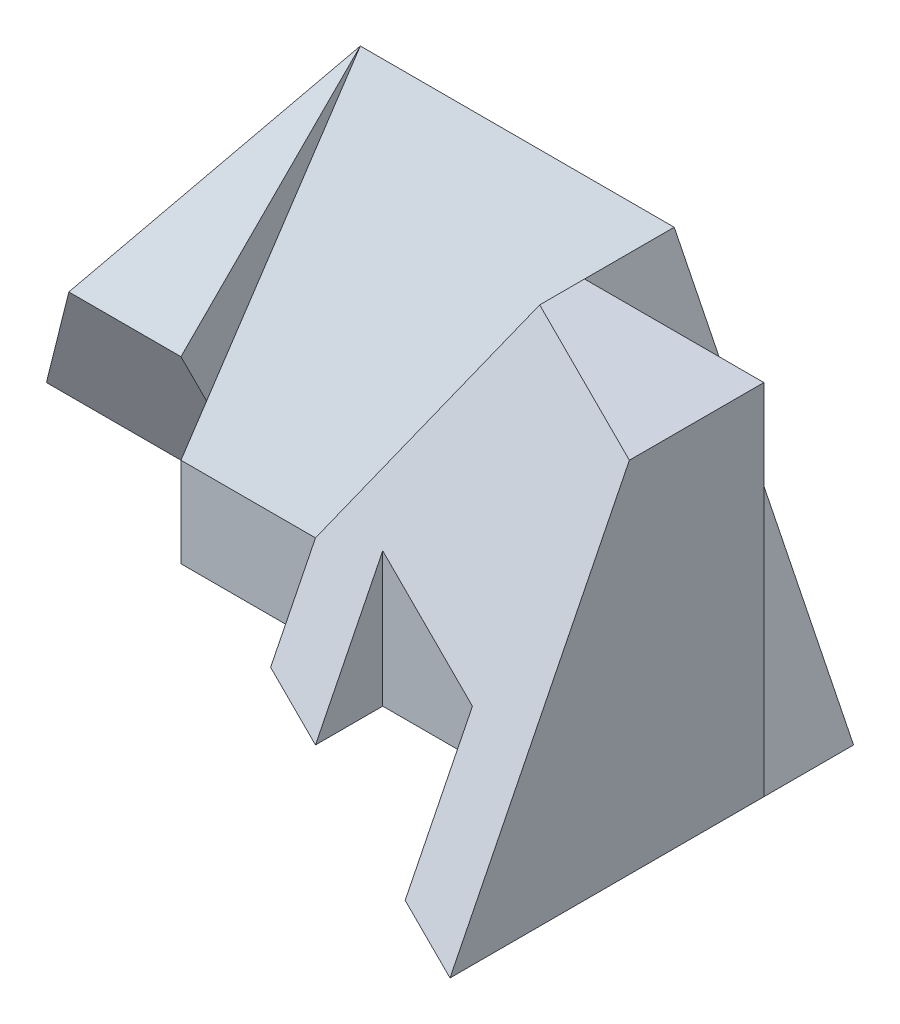
ISO-10303-21;
HEADER;
FILE_DESCRIPTION(('STEP AP214'),'2;1');
FILE_NAME('part.step','',(''),(''),'','','');
FILE_SCHEMA(('AUTOMOTIVE_DESIGN { 1 0 10303 214 1 1 1 1 }'));
ENDSEC;
DATA;
#1=APPLICATION_CONTEXT('core data for automotive mechanical design processes');
#2=APPLICATION_PROTOCOL_DEFINITION('international standard','automotive_design',2000,#1);
#3=PRODUCT_CONTEXT('',#1,'mechanical');
#4=PRODUCT('Part','Part','',(#3));
#5=PRODUCT_RELATED_PRODUCT_CATEGORY('part','',(#4));
#6=PRODUCT_DEFINITION_FORMATION('','',#4);
#7=PRODUCT_DEFINITION_CONTEXT('part definition',#1,'design');
#8=PRODUCT_DEFINITION('design','',#6,#7);
#9=PRODUCT_DEFINITION_SHAPE('','',#8);
#10=(LENGTH_UNIT() NAMED_UNIT(*) SI_UNIT(.MILLI.,.METRE.));
#11=(NAMED_UNIT(*) PLANE_ANGLE_UNIT() SI_UNIT($,.RADIAN.));
#12=(NAMED_UNIT(*) SI_UNIT($,.STERADIAN.) SOLID_ANGLE_UNIT());
#13=UNCERTAINTY_MEASURE_WITH_UNIT(LENGTH_MEASURE(1.E-05),#10,'distance_accuracy_value','');
#14=(GEOMETRIC_REPRESENTATION_CONTEXT(3) GLOBAL_UNCERTAINTY_ASSIGNED_CONTEXT((#13)) GLOBAL_UNIT_ASSIGNED_CONTEXT((#10,
#11,#12)) REPRESENTATION_CONTEXT('',''));
#15=CARTESIAN_POINT('',(0.,0.,0.));
#16=DIRECTION('',(0.,0.,1.));
#17=DIRECTION('',(1.,0.,0.));
#18=AXIS2_PLACEMENT_3D('',#15,#16,#17);
#19=CARTESIAN_POINT('',(0.,4.,4.));
#20=DIRECTION('',(0.,1.,0.));
#21=DIRECTION('',(0.,0.,1.));
#22=AXIS2_PLACEMENT_3D('',#19,#20,#21);
#23=PLANE('',#22);
#24=DIRECTION('',(0.,0.,1.));
#25=VECTOR('',#24,1.);
#26=CARTESIAN_POINT('',(1.5,4.,0.));
#27=LINE('',#26,#25);
#28=CARTESIAN_POINT('',(1.5,4.,2.));
#29=VERTEX_POINT('',#28);
#30=CARTESIAN_POINT('',(1.5,4.,3.));
#31=VERTEX_POINT('',#30);
#32=EDGE_CURVE('E163',#29,#31,#27,.T.);
#33=ORIENTED_EDGE('',*,*,#32,.T.);
#34=DIRECTION('',(0.894427190999916,0.,0.447213595499958));
#35=VECTOR('',#34,1.);
#36=CARTESIAN_POINT('',(1.5,4.,3.));
#37=LINE('',#36,#35);
#38=CARTESIAN_POINT('',(5.5,4.,5.));
#39=VERTEX_POINT('',#38);
#40=EDGE_CURVE('E77',#31,#39,#37,.T.);
#41=ORIENTED_EDGE('',*,*,#40,.T.);
#42=DIRECTION('',(0.,0.,-1.));
#43=VECTOR('',#42,1.);
#44=CARTESIAN_POINT('',(5.5,4.,4.));
#45=LINE('',#44,#43);
#46=CARTESIAN_POINT('',(5.5,4.,2.));
#47=VERTEX_POINT('',#46);
#48=EDGE_CURVE('E82',#39,#47,#45,.T.);
#49=ORIENTED_EDGE('',*,*,#48,.T.);
#50=DIRECTION('',(1.,0.,0.));
#51=VECTOR('',#50,1.);
#52=CARTESIAN_POINT('',(1.5,4.,2.));
#53=LINE('',#52,#51);
#54=EDGE_CURVE('E228',#29,#47,#53,.T.);
#55=ORIENTED_EDGE('',*,*,#54,.F.);
#56=EDGE_LOOP('',(#33,#41,#49,#55));
#57=FACE_BOUND('',#56,.T.);
#58=ADVANCED_FACE('F39',(#57),#23,.T.);
#59=CARTESIAN_POINT('',(-2.5,-2.,4.));
#60=DIRECTION('',(0.832050294337844,-0.554700196225229,0.));
#61=DIRECTION('',(0.554700196225229,0.832050294337844,0.));
#62=AXIS2_PLACEMENT_3D('',#59,#60,#61);
#63=PLANE('',#62);
#64=DIRECTION('',(0.549442255794756,0.824163383692134,-0.137360563948689));
#65=VECTOR('',#64,1.);
#66=CARTESIAN_POINT('',(-2.5,-2.,4.));
#67=LINE('',#66,#65);
#68=CARTESIAN_POINT('',(-2.5,-2.,4.));
#69=VERTEX_POINT('',#68);
#70=EDGE_CURVE('E71',#69,#31,#67,.T.);
#71=ORIENTED_EDGE('',*,*,#70,.T.);
#72=ORIENTED_EDGE('',*,*,#32,.F.);
#73=CARTESIAN_POINT('',(1.5,4.,0.));
#74=VERTEX_POINT('',#73);
#75=EDGE_CURVE('E112',#74,#29,#27,.T.);
#76=ORIENTED_EDGE('',*,*,#75,.F.);
#77=DIRECTION('',(0.485071250072666,0.727606875108999,-0.485071250072666));
#78=VECTOR('',#77,1.);
#79=CARTESIAN_POINT('',(-2.5,-2.,4.));
#80=LINE('',#79,#78);
#81=EDGE_CURVE('E108',#69,#74,#80,.T.);
#82=ORIENTED_EDGE('',*,*,#81,.F.);
#83=EDGE_LOOP('',(#71,#72,#76,#82));
#84=FACE_BOUND('',#83,.T.);
#85=ADVANCED_FACE('F109',(#84),#63,.F.);
#86=CARTESIAN_POINT('',(-2.5,-2.,9.));
#87=DIRECTION('',(1.,0.,0.));
#88=DIRECTION('',(0.,0.,-1.));
#89=AXIS2_PLACEMENT_3D('',#86,#87,#88);
#90=PLANE('',#89);
#91=DIRECTION('',(0.,0.894427190999916,-0.447213595499958));
#92=VECTOR('',#91,1.);
#93=CARTESIAN_POINT('',(-2.5,-4.,5.));
#94=LINE('',#93,#92);
#95=CARTESIAN_POINT('',(-2.5,-4.,5.));
#96=VERTEX_POINT('',#95);
#97=EDGE_CURVE('E74',#96,#69,#94,.T.);
#98=ORIENTED_EDGE('',*,*,#97,.T.);
#99=DIRECTION('',(0.,-1.,0.));
#100=VECTOR('',#99,1.);
#101=CARTESIAN_POINT('',(-2.5,-2.,4.));
#102=LINE('',#101,#100);
#103=CARTESIAN_POINT('',(-2.5,-4.,4.));
#104=VERTEX_POINT('',#103);
#105=EDGE_CURVE('E90',#69,#104,#102,.T.);
#106=ORIENTED_EDGE('',*,*,#105,.T.);
#107=DIRECTION('',(0.,0.,-1.));
#108=VECTOR('',#107,1.);
#109=CARTESIAN_POINT('',(-2.5,-4.,9.));
#110=LINE('',#109,#108);
#111=EDGE_CURVE('E92',#96,#104,#110,.T.);
#112=ORIENTED_EDGE('',*,*,#111,.F.);
#113=EDGE_LOOP('',(#98,#106,#112));
#114=FACE_BOUND('',#113,.T.);
#115=ADVANCED_FACE('F88',(#114),#90,.F.);
#116=CARTESIAN_POINT('',(-0.5,-4.,4.5));
#117=DIRECTION('',(-1.,0.,0.));
#118=DIRECTION('',(0.,0.,1.));
#119=AXIS2_PLACEMENT_3D('',#116,#117,#118);
#120=PLANE('',#119);
#121=DIRECTION('',(0.,0.894427190999916,-0.447213595499958));
#122=VECTOR('',#121,1.);
#123=CARTESIAN_POINT('',(-0.5,-3.4,5.7));
#124=LINE('',#123,#122);
#125=CARTESIAN_POINT('',(-0.500000000000001,-4.,6.));
#126=VERTEX_POINT('',#125);
#127=CARTESIAN_POINT('',(-0.5,-1.,4.5));
#128=VERTEX_POINT('',#127);
#129=EDGE_CURVE('E188',#126,#128,#124,.T.);
#130=ORIENTED_EDGE('',*,*,#129,.F.);
#131=DIRECTION('',(0.,0.,1.));
#132=VECTOR('',#131,1.);
#133=CARTESIAN_POINT('',(-0.5,-4.,4.5));
#134=LINE('',#133,#132);
#135=CARTESIAN_POINT('',(-0.5,-4.,4.5));
#136=VERTEX_POINT('',#135);
#137=EDGE_CURVE('E181',#136,#126,#134,.T.);
#138=ORIENTED_EDGE('',*,*,#137,.F.);
#139=DIRECTION('',(0.,-1.,0.));
#140=VECTOR('',#139,1.);
#141=CARTESIAN_POINT('',(-0.5,-4.,4.5));
#142=LINE('',#141,#140);
#143=EDGE_CURVE('E186',#128,#136,#142,.T.);
#144=ORIENTED_EDGE('',*,*,#143,.F.);
#145=EDGE_LOOP('',(#130,#138,#144));
#146=FACE_BOUND('',#145,.T.);
#147=ADVANCED_FACE('F409',(#146),#120,.F.);
#148=CARTESIAN_POINT('',(-0.5,-1.,4.5));
#149=DIRECTION('',(0.,1.,0.));
#150=DIRECTION('',(0.,0.,1.));
#151=AXIS2_PLACEMENT_3D('',#148,#149,#150);
#152=PLANE('',#151);
#153=DIRECTION('',(0.894427190999916,0.,0.447213595499958));
#154=VECTOR('',#153,1.);
#155=CARTESIAN_POINT('',(-0.500000000000002,-1.,4.5));
#156=LINE('',#155,#154);
#157=CARTESIAN_POINT('',(3.5,-1.,6.5));
#158=VERTEX_POINT('',#157);
#159=EDGE_CURVE('E49',#128,#158,#156,.T.);
#160=ORIENTED_EDGE('',*,*,#159,.F.);
#161=DIRECTION('',(-1.,0.,0.));
#162=VECTOR('',#161,1.);
#163=CARTESIAN_POINT('',(-0.5,-1.,4.5));
#164=LINE('',#163,#162);
#165=CARTESIAN_POINT('',(3.5,-1.,4.5));
#166=VERTEX_POINT('',#165);
#167=EDGE_CURVE('E191',#166,#128,#164,.T.);
#168=ORIENTED_EDGE('',*,*,#167,.F.);
#169=DIRECTION('',(0.,0.,1.));
#170=VECTOR('',#169,1.);
#171=CARTESIAN_POINT('',(3.5,-1.,4.5));
#172=LINE('',#171,#170);
#173=EDGE_CURVE('E104',#166,#158,#172,.T.);
#174=ORIENTED_EDGE('',*,*,#173,.T.);
#175=EDGE_LOOP('',(#160,#168,#174));
#176=FACE_BOUND('',#175,.T.);
#177=ADVANCED_FACE('F405',(#176),#152,.F.);
#178=CARTESIAN_POINT('',(3.5,-4.,4.5));
#179=DIRECTION('',(1.,0.,0.));
#180=DIRECTION('',(0.,0.,-1.));
#181=AXIS2_PLACEMENT_3D('',#178,#179,#180);
#182=PLANE('',#181);
#183=DIRECTION('',(0.,-0.894427190999916,0.447213595499958));
#184=VECTOR('',#183,1.);
#185=CARTESIAN_POINT('',(3.5,-2.6,7.3));
#186=LINE('',#185,#184);
#187=CARTESIAN_POINT('',(3.5,-4.,8.));
#188=VERTEX_POINT('',#187);
#189=EDGE_CURVE('E12',#158,#188,#186,.T.);
#190=ORIENTED_EDGE('',*,*,#189,.F.);
#191=ORIENTED_EDGE('',*,*,#173,.F.);
#192=DIRECTION('',(0.,1.,0.));
#193=VECTOR('',#192,1.);
#194=CARTESIAN_POINT('',(3.5,-4.,4.5));
#195=LINE('',#194,#193);
#196=CARTESIAN_POINT('',(3.5,-4.,4.5));
#197=VERTEX_POINT('',#196);
#198=EDGE_CURVE('E218',#197,#166,#195,.T.);
#199=ORIENTED_EDGE('',*,*,#198,.F.);
#200=DIRECTION('',(0.,0.,1.));
#201=VECTOR('',#200,1.);
#202=CARTESIAN_POINT('',(3.5,-4.,4.5));
#203=LINE('',#202,#201);
#204=EDGE_CURVE('E200',#197,#188,#203,.T.);
#205=ORIENTED_EDGE('',*,*,#204,.T.);
#206=EDGE_LOOP('',(#190,#191,#199,#205));
#207=FACE_BOUND('',#206,.T.);
#208=ADVANCED_FACE('F408',(#207),#182,.F.);
#209=CARTESIAN_POINT('',(5.5,0.,4.));
#210=DIRECTION('',(-1.,0.,0.));
#211=DIRECTION('',(0.,0.,1.));
#212=AXIS2_PLACEMENT_3D('',#209,#210,#211);
#213=PLANE('',#212);
#214=ORIENTED_EDGE('',*,*,#48,.F.);
#215=DIRECTION('',(0.,-0.894427190999916,0.447213595499958));
#216=VECTOR('',#215,1.);
#217=CARTESIAN_POINT('',(5.5,4.,5.));
#218=LINE('',#217,#216);
#219=CARTESIAN_POINT('',(5.5,-4.,9.));
#220=VERTEX_POINT('',#219);
#221=EDGE_CURVE('E160',#39,#220,#218,.T.);
#222=ORIENTED_EDGE('',*,*,#221,.T.);
#223=DIRECTION('',(0.,0.,-1.));
#224=VECTOR('',#223,1.);
#225=CARTESIAN_POINT('',(5.5,-4.,4.));
#226=LINE('',#225,#224);
#227=CARTESIAN_POINT('',(5.5,-4.,2.));
#228=VERTEX_POINT('',#227);
#229=EDGE_CURVE('E148',#220,#228,#226,.T.);
#230=ORIENTED_EDGE('',*,*,#229,.T.);
#231=DIRECTION('',(0.,-1.,0.));
#232=VECTOR('',#231,1.);
#233=CARTESIAN_POINT('',(5.5,0.,2.));
#234=LINE('',#233,#232);
#235=EDGE_CURVE('E314',#47,#228,#234,.T.);
#236=ORIENTED_EDGE('',*,*,#235,.F.);
#237=EDGE_LOOP('',(#214,#222,#230,#236));
#238=FACE_BOUND('',#237,.T.);
#239=ADVANCED_FACE('F41',(#238),#213,.F.);
#240=CARTESIAN_POINT('',(-5.75280898876405,3.59550561797753,4.));
#241=DIRECTION('',(0.847998304005088,-0.52999894000318,0.));
#242=DIRECTION('',(0.52999894000318,0.847998304005088,0.));
#243=AXIS2_PLACEMENT_3D('',#240,#241,#242);
#244=PLANE('',#243);
#245=DIRECTION('',(-0.487950036474267,-0.780720058358827,-0.390360029179413));
#246=VECTOR('',#245,1.);
#247=CARTESIAN_POINT('',(-6.0952380952381,3.04761904761905,5.52380952380952));
#248=LINE('',#247,#246);
#249=CARTESIAN_POINT('',(-8.,0.,4.));
#250=VERTEX_POINT('',#249);
#251=CARTESIAN_POINT('',(-10.5,-4.,2.));
#252=VERTEX_POINT('',#251);
#253=EDGE_CURVE('E116',#250,#252,#248,.T.);
#254=ORIENTED_EDGE('',*,*,#253,.F.);
#255=DIRECTION('',(-0.404226041727222,-0.646761666763555,0.646761666763555));
#256=VECTOR('',#255,1.);
#257=CARTESIAN_POINT('',(-5.5,4.,0.));
#258=LINE('',#257,#256);
#259=CARTESIAN_POINT('',(-5.5,4.,0.));
#260=VERTEX_POINT('',#259);
#261=EDGE_CURVE('E247',#260,#250,#258,.T.);
#262=ORIENTED_EDGE('',*,*,#261,.F.);
#263=DIRECTION('',(-0.52999894000318,-0.847998304005088,0.));
#264=VECTOR('',#263,1.);
#265=CARTESIAN_POINT('',(-5.75280898876405,3.59550561797753,0.));
#266=LINE('',#265,#264);
#267=CARTESIAN_POINT('',(-8.,0.,0.));
#268=VERTEX_POINT('',#267);
#269=EDGE_CURVE('E144',#260,#268,#266,.T.);
#270=ORIENTED_EDGE('',*,*,#269,.T.);
#271=DIRECTION('',(0.,0.,-1.));
#272=VECTOR('',#271,1.);
#273=CARTESIAN_POINT('',(-8.,0.,1.));
#274=LINE('',#273,#272);
#275=CARTESIAN_POINT('',(-8.,0.,1.));
#276=VERTEX_POINT('',#275);
#277=EDGE_CURVE('E250',#276,#268,#274,.T.);
#278=ORIENTED_EDGE('',*,*,#277,.F.);
#279=DIRECTION('',(-0.52999894000318,-0.847998304005088,0.));
#280=VECTOR('',#279,1.);
#281=CARTESIAN_POINT('',(-5.75280898876405,3.59550561797753,1.));
#282=LINE('',#281,#280);
#283=CARTESIAN_POINT('',(-10.5,-4.,1.));
#284=VERTEX_POINT('',#283);
#285=EDGE_CURVE('E147',#276,#284,#282,.T.);
#286=ORIENTED_EDGE('',*,*,#285,.T.);
#287=DIRECTION('',(0.,0.,-1.));
#288=VECTOR('',#287,1.);
#289=CARTESIAN_POINT('',(-10.5,-4.,4.));
#290=LINE('',#289,#288);
#291=EDGE_CURVE('E149',#252,#284,#290,.T.);
#292=ORIENTED_EDGE('',*,*,#291,.F.);
#293=EDGE_LOOP('',(#254,#262,#270,#278,#286,#292));
#294=FACE_BOUND('',#293,.T.);
#295=ADVANCED_FACE('F276',(#294),#244,.F.);
#296=CARTESIAN_POINT('',(0.,-4.,4.));
#297=DIRECTION('',(0.,1.,0.));
#298=DIRECTION('',(0.,0.,1.));
#299=AXIS2_PLACEMENT_3D('',#296,#297,#298);
#300=PLANE('',#299);
#301=ORIENTED_EDGE('',*,*,#229,.F.);
#302=DIRECTION('',(-0.894427190999916,0.,-0.447213595499958));
#303=VECTOR('',#302,1.);
#304=CARTESIAN_POINT('',(-0.9,-4.,5.8));
#305=LINE('',#304,#303);
#306=EDGE_CURVE('E176',#220,#188,#305,.T.);
#307=ORIENTED_EDGE('',*,*,#306,.T.);
#308=ORIENTED_EDGE('',*,*,#204,.F.);
#309=DIRECTION('',(1.,0.,0.));
#310=VECTOR('',#309,1.);
#311=CARTESIAN_POINT('',(-0.5,-4.,4.5));
#312=LINE('',#311,#310);
#313=EDGE_CURVE('E220',#136,#197,#312,.T.);
#314=ORIENTED_EDGE('',*,*,#313,.F.);
#315=ORIENTED_EDGE('',*,*,#137,.T.);
#316=EDGE_CURVE('E58',#126,#96,#305,.T.);
#317=ORIENTED_EDGE('',*,*,#316,.T.);
#318=ORIENTED_EDGE('',*,*,#111,.T.);
#319=DIRECTION('',(1.,0.,0.));
#320=VECTOR('',#319,1.);
#321=CARTESIAN_POINT('',(0.,-4.,4.));
#322=LINE('',#321,#320);
#323=CARTESIAN_POINT('',(-5.5,-4.,4.));
#324=VERTEX_POINT('',#323);
#325=EDGE_CURVE('E103',#324,#104,#322,.T.);
#326=ORIENTED_EDGE('',*,*,#325,.F.);
#327=DIRECTION('',(0.,0.,1.));
#328=VECTOR('',#327,1.);
#329=CARTESIAN_POINT('',(-5.5,-4.,4.));
#330=LINE('',#329,#328);
#331=CARTESIAN_POINT('',(-5.5,-4.,2.));
#332=VERTEX_POINT('',#331);
#333=EDGE_CURVE('E324',#332,#324,#330,.T.);
#334=ORIENTED_EDGE('',*,*,#333,.F.);
#335=DIRECTION('',(1.,0.,0.));
#336=VECTOR('',#335,1.);
#337=CARTESIAN_POINT('',(-29.,-4.,2.));
#338=LINE('',#337,#336);
#339=EDGE_CURVE('E336',#252,#332,#338,.T.);
#340=ORIENTED_EDGE('',*,*,#339,.F.);
#341=ORIENTED_EDGE('',*,*,#291,.T.);
#342=DIRECTION('',(-1.,0.,0.));
#343=VECTOR('',#342,1.);
#344=CARTESIAN_POINT('',(-8.,-4.,1.));
#345=LINE('',#344,#343);
#346=CARTESIAN_POINT('',(-8.,-4.,1.));
#347=VERTEX_POINT('',#346);
#348=EDGE_CURVE('E260',#347,#284,#345,.T.);
#349=ORIENTED_EDGE('',*,*,#348,.F.);
#350=DIRECTION('',(0.,0.,-1.));
#351=VECTOR('',#350,1.);
#352=CARTESIAN_POINT('',(-8.,-4.,1.));
#353=LINE('',#352,#351);
#354=CARTESIAN_POINT('',(-8.,-4.,0.));
#355=VERTEX_POINT('',#354);
#356=EDGE_CURVE('E152',#347,#355,#353,.T.);
#357=ORIENTED_EDGE('',*,*,#356,.T.);
#358=DIRECTION('',(1.,0.,0.));
#359=VECTOR('',#358,1.);
#360=CARTESIAN_POINT('',(0.,-4.,0.));
#361=LINE('',#360,#359);
#362=CARTESIAN_POINT('',(5.5,-4.,0.));
#363=VERTEX_POINT('',#362);
#364=EDGE_CURVE('E161',#355,#363,#361,.T.);
#365=ORIENTED_EDGE('',*,*,#364,.T.);
#366=DIRECTION('',(0.,0.,1.));
#367=VECTOR('',#366,1.);
#368=CARTESIAN_POINT('',(5.5,-4.,0.));
#369=LINE('',#368,#367);
#370=EDGE_CURVE('E304',#363,#228,#369,.T.);
#371=ORIENTED_EDGE('',*,*,#370,.T.);
#372=EDGE_LOOP('',(#301,#307,#308,#314,#315,#317,#318,#326,#334,#340,#341,#349,#357,#365,#371));
#373=FACE_BOUND('',#372,.T.);
#374=ADVANCED_FACE('F296',(#373),#300,.F.);
#375=CARTESIAN_POINT('',(0.,0.,4.));
#376=DIRECTION('',(0.,0.,1.));
#377=DIRECTION('',(1.,0.,0.));
#378=AXIS2_PLACEMENT_3D('',#375,#376,#377);
#379=PLANE('',#378);
#380=ORIENTED_EDGE('',*,*,#105,.F.);
#381=DIRECTION('',(1.,0.,0.));
#382=VECTOR('',#381,1.);
#383=CARTESIAN_POINT('',(-5.5,-2.,4.));
#384=LINE('',#383,#382);
#385=CARTESIAN_POINT('',(-5.5,-2.,4.));
#386=VERTEX_POINT('',#385);
#387=EDGE_CURVE('E101',#386,#69,#384,.T.);
#388=ORIENTED_EDGE('',*,*,#387,.F.);
#389=DIRECTION('',(0.,1.,0.));
#390=VECTOR('',#389,1.);
#391=CARTESIAN_POINT('',(-5.5,0.,4.));
#392=LINE('',#391,#390);
#393=EDGE_CURVE('E321',#324,#386,#392,.T.);
#394=ORIENTED_EDGE('',*,*,#393,.F.);
#395=ORIENTED_EDGE('',*,*,#325,.T.);
#396=EDGE_LOOP('',(#380,#388,#394,#395));
#397=FACE_BOUND('',#396,.T.);
#398=ADVANCED_FACE('F97',(#397),#379,.T.);
#399=CARTESIAN_POINT('',(-5.5,4.,0.));
#400=DIRECTION('',(-1.,0.,0.));
#401=DIRECTION('',(0.,-1.,0.));
#402=AXIS2_PLACEMENT_3D('',#399,#400,#401);
#403=PLANE('',#402);
#404=DIRECTION('',(0.,-0.894427190999916,-0.447213595499958));
#405=VECTOR('',#404,1.);
#406=CARTESIAN_POINT('',(-5.5,-4.,2.));
#407=LINE('',#406,#405);
#408=CARTESIAN_POINT('',(-5.5,0.,4.));
#409=VERTEX_POINT('',#408);
#410=CARTESIAN_POINT('',(-5.5,-1.14285714285714,3.42857142857143));
#411=VERTEX_POINT('',#410);
#412=EDGE_CURVE('E135',#409,#411,#407,.T.);
#413=ORIENTED_EDGE('',*,*,#412,.T.);
#414=DIRECTION('',(0.,-0.832050294337844,0.554700196225229));
#415=VECTOR('',#414,1.);
#416=CARTESIAN_POINT('',(-5.5,4.,0.));
#417=LINE('',#416,#415);
#418=EDGE_CURVE('E124',#260,#411,#417,.T.);
#419=ORIENTED_EDGE('',*,*,#418,.F.);
#420=DIRECTION('',(0.,0.707106781186548,-0.707106781186548));
#421=VECTOR('',#420,1.);
#422=CARTESIAN_POINT('',(-5.5,0.,4.));
#423=LINE('',#422,#421);
#424=EDGE_CURVE('E240',#409,#260,#423,.T.);
#425=ORIENTED_EDGE('',*,*,#424,.F.);
#426=EDGE_LOOP('',(#413,#419,#425));
#427=FACE_BOUND('',#426,.T.);
#428=ADVANCED_FACE('F430',(#427),#403,.F.);
#429=CARTESIAN_POINT('',(0.,0.,0.));
#430=DIRECTION('',(0.,0.,1.));
#431=DIRECTION('',(1.,0.,0.));
#432=AXIS2_PLACEMENT_3D('',#429,#430,#431);
#433=PLANE('',#432);
#434=DIRECTION('',(1.,0.,0.));
#435=VECTOR('',#434,1.);
#436=CARTESIAN_POINT('',(0.,4.,0.));
#437=LINE('',#436,#435);
#438=EDGE_CURVE('E139',#260,#74,#437,.T.);
#439=ORIENTED_EDGE('',*,*,#438,.T.);
#440=DIRECTION('',(0.447213595499958,-0.894427190999916,0.));
#441=VECTOR('',#440,1.);
#442=CARTESIAN_POINT('',(1.5,4.,0.));
#443=LINE('',#442,#441);
#444=EDGE_CURVE('E141',#74,#363,#443,.T.);
#445=ORIENTED_EDGE('',*,*,#444,.T.);
#446=ORIENTED_EDGE('',*,*,#364,.F.);
#447=DIRECTION('',(0.,-1.,0.));
#448=VECTOR('',#447,1.);
#449=CARTESIAN_POINT('',(-8.,-4.,0.));
#450=LINE('',#449,#448);
#451=EDGE_CURVE('E263',#268,#355,#450,.T.);
#452=ORIENTED_EDGE('',*,*,#451,.F.);
#453=ORIENTED_EDGE('',*,*,#269,.F.);
#454=EDGE_LOOP('',(#439,#445,#446,#452,#453));
#455=FACE_BOUND('',#454,.T.);
#456=ADVANCED_FACE('F302',(#455),#433,.F.);
#457=CARTESIAN_POINT('',(0.,0.,1.));
#458=DIRECTION('',(0.,0.,1.));
#459=DIRECTION('',(1.,0.,0.));
#460=AXIS2_PLACEMENT_3D('',#457,#458,#459);
#461=PLANE('',#460);
#462=DIRECTION('',(0.,-1.,0.));
#463=VECTOR('',#462,1.);
#464=CARTESIAN_POINT('',(-8.,-4.,1.));
#465=LINE('',#464,#463);
#466=EDGE_CURVE('E257',#276,#347,#465,.T.);
#467=ORIENTED_EDGE('',*,*,#466,.T.);
#468=ORIENTED_EDGE('',*,*,#348,.T.);
#469=ORIENTED_EDGE('',*,*,#285,.F.);
#470=EDGE_LOOP('',(#467,#468,#469));
#471=FACE_BOUND('',#470,.T.);
#472=ADVANCED_FACE('F282',(#471),#461,.F.);
#473=CARTESIAN_POINT('',(-8.,-4.,1.));
#474=DIRECTION('',(1.,0.,0.));
#475=DIRECTION('',(0.,0.,-1.));
#476=AXIS2_PLACEMENT_3D('',#473,#474,#475);
#477=PLANE('',#476);
#478=ORIENTED_EDGE('',*,*,#451,.T.);
#479=ORIENTED_EDGE('',*,*,#356,.F.);
#480=ORIENTED_EDGE('',*,*,#466,.F.);
#481=ORIENTED_EDGE('',*,*,#277,.T.);
#482=EDGE_LOOP('',(#478,#479,#480,#481));
#483=FACE_BOUND('',#482,.T.);
#484=ADVANCED_FACE('F289',(#483),#477,.F.);
#485=CARTESIAN_POINT('',(0.,2.,2.));
#486=DIRECTION('',(0.,-0.707106781186547,-0.707106781186548));
#487=DIRECTION('',(0.,0.707106781186548,-0.707106781186547));
#488=AXIS2_PLACEMENT_3D('',#485,#486,#487);
#489=PLANE('',#488);
#490=ORIENTED_EDGE('',*,*,#261,.T.);
#491=DIRECTION('',(1.,0.,0.));
#492=VECTOR('',#491,1.);
#493=CARTESIAN_POINT('',(-8.,0.,4.));
#494=LINE('',#493,#492);
#495=EDGE_CURVE('E244',#250,#409,#494,.T.);
#496=ORIENTED_EDGE('',*,*,#495,.T.);
#497=ORIENTED_EDGE('',*,*,#424,.T.);
#498=EDGE_LOOP('',(#490,#496,#497));
#499=FACE_BOUND('',#498,.T.);
#500=ADVANCED_FACE('F436',(#499),#489,.F.);
#501=CARTESIAN_POINT('',(0.,1.23076923076923,1.84615384615384));
#502=DIRECTION('',(0.,0.55470019622523,0.832050294337843));
#503=DIRECTION('',(0.,-0.832050294337843,0.55470019622523));
#504=AXIS2_PLACEMENT_3D('',#501,#502,#503);
#505=PLANE('',#504);
#506=ORIENTED_EDGE('',*,*,#438,.F.);
#507=ORIENTED_EDGE('',*,*,#418,.T.);
#508=EDGE_CURVE('E122',#411,#386,#417,.T.);
#509=ORIENTED_EDGE('',*,*,#508,.T.);
#510=ORIENTED_EDGE('',*,*,#387,.T.);
#511=ORIENTED_EDGE('',*,*,#81,.T.);
#512=EDGE_LOOP('',(#506,#507,#509,#510,#511));
#513=FACE_BOUND('',#512,.T.);
#514=ADVANCED_FACE('F119',(#513),#505,.T.);
#515=CARTESIAN_POINT('',(-29.,-4.,2.));
#516=DIRECTION('',(0.,-0.447213595499958,0.894427190999916));
#517=DIRECTION('',(0.,-0.894427190999916,-0.447213595499958));
#518=AXIS2_PLACEMENT_3D('',#515,#516,#517);
#519=PLANE('',#518);
#520=ORIENTED_EDGE('',*,*,#253,.T.);
#521=ORIENTED_EDGE('',*,*,#339,.T.);
#522=EDGE_CURVE('E327',#411,#332,#407,.T.);
#523=ORIENTED_EDGE('',*,*,#522,.F.);
#524=ORIENTED_EDGE('',*,*,#412,.F.);
#525=ORIENTED_EDGE('',*,*,#495,.F.);
#526=EDGE_LOOP('',(#520,#521,#523,#524,#525));
#527=FACE_BOUND('',#526,.T.);
#528=ADVANCED_FACE('F427',(#527),#519,.T.);
#529=CARTESIAN_POINT('',(-5.5,0.,0.));
#530=DIRECTION('',(-1.,0.,0.));
#531=DIRECTION('',(0.,0.,1.));
#532=AXIS2_PLACEMENT_3D('',#529,#530,#531);
#533=PLANE('',#532);
#534=ORIENTED_EDGE('',*,*,#522,.T.);
#535=ORIENTED_EDGE('',*,*,#333,.T.);
#536=ORIENTED_EDGE('',*,*,#393,.T.);
#537=ORIENTED_EDGE('',*,*,#508,.F.);
#538=EDGE_LOOP('',(#534,#535,#536,#537));
#539=FACE_BOUND('',#538,.T.);
#540=ADVANCED_FACE('F345',(#539),#533,.T.);
#541=CARTESIAN_POINT('',(5.5,-4.,2.));
#542=DIRECTION('',(0.,0.,-1.));
#543=DIRECTION('',(-1.,0.,0.));
#544=AXIS2_PLACEMENT_3D('',#541,#542,#543);
#545=PLANE('',#544);
#546=ORIENTED_EDGE('',*,*,#235,.T.);
#547=DIRECTION('',(-0.447213595499958,0.894427190999916,0.));
#548=VECTOR('',#547,1.);
#549=CARTESIAN_POINT('',(5.5,-4.,2.));
#550=LINE('',#549,#548);
#551=EDGE_CURVE('E236',#228,#29,#550,.T.);
#552=ORIENTED_EDGE('',*,*,#551,.T.);
#553=ORIENTED_EDGE('',*,*,#54,.T.);
#554=EDGE_LOOP('',(#546,#552,#553));
#555=FACE_BOUND('',#554,.T.);
#556=ADVANCED_FACE('F384',(#555),#545,.T.);
#557=CARTESIAN_POINT('',(2.8,1.4,0.));
#558=DIRECTION('',(-0.894427190999916,-0.447213595499958,0.));
#559=DIRECTION('',(0.447213595499958,-0.894427190999916,0.));
#560=AXIS2_PLACEMENT_3D('',#557,#558,#559);
#561=PLANE('',#560);
#562=ORIENTED_EDGE('',*,*,#75,.T.);
#563=ORIENTED_EDGE('',*,*,#551,.F.);
#564=ORIENTED_EDGE('',*,*,#370,.F.);
#565=ORIENTED_EDGE('',*,*,#444,.F.);
#566=EDGE_LOOP('',(#562,#563,#564,#565));
#567=FACE_BOUND('',#566,.T.);
#568=ADVANCED_FACE('F385',(#567),#561,.F.);
#569=CARTESIAN_POINT('',(0.,0.,4.5));
#570=DIRECTION('',(0.,0.,-1.));
#571=DIRECTION('',(-1.,0.,0.));
#572=AXIS2_PLACEMENT_3D('',#569,#570,#571);
#573=PLANE('',#572);
#574=ORIENTED_EDGE('',*,*,#143,.T.);
#575=ORIENTED_EDGE('',*,*,#313,.T.);
#576=ORIENTED_EDGE('',*,*,#198,.T.);
#577=ORIENTED_EDGE('',*,*,#167,.T.);
#578=EDGE_LOOP('',(#574,#575,#576,#577));
#579=FACE_BOUND('',#578,.T.);
#580=ADVANCED_FACE('F387',(#579),#573,.F.);
#581=CARTESIAN_POINT('',(-1.41666666666667,1.41666666666667,2.83333333333334));
#582=DIRECTION('',(-0.408248290463863,0.408248290463863,0.816496580927726));
#583=DIRECTION('',(0.,-0.894427190999916,0.447213595499958));
#584=AXIS2_PLACEMENT_3D('',#581,#582,#583);
#585=PLANE('',#584);
#586=ORIENTED_EDGE('',*,*,#129,.T.);
#587=ORIENTED_EDGE('',*,*,#159,.T.);
#588=ORIENTED_EDGE('',*,*,#189,.T.);
#589=ORIENTED_EDGE('',*,*,#306,.F.);
#590=ORIENTED_EDGE('',*,*,#221,.F.);
#591=ORIENTED_EDGE('',*,*,#40,.F.);
#592=ORIENTED_EDGE('',*,*,#70,.F.);
#593=ORIENTED_EDGE('',*,*,#97,.F.);
#594=ORIENTED_EDGE('',*,*,#316,.F.);
#595=EDGE_LOOP('',(#586,#587,#588,#589,#590,#591,#592,#593,#594));
#596=FACE_BOUND('',#595,.T.);
#597=ADVANCED_FACE('F73',(#596),#585,.T.);
#598=CLOSED_SHELL('',(#58,#85,#115,#147,#177,#208,#239,#295,#374,#398,#428,#456,#472,#484,#500,
#514,#528,#540,#556,#568,#580,#597));
#599=MANIFOLD_SOLID_BREP('B2',#598);
#600=ADVANCED_BREP_SHAPE_REPRESENTATION('',(#18,#599),#14);
#601=SHAPE_DEFINITION_REPRESENTATION(#9,#600);
ENDSEC;
END-ISO-10303-21;
